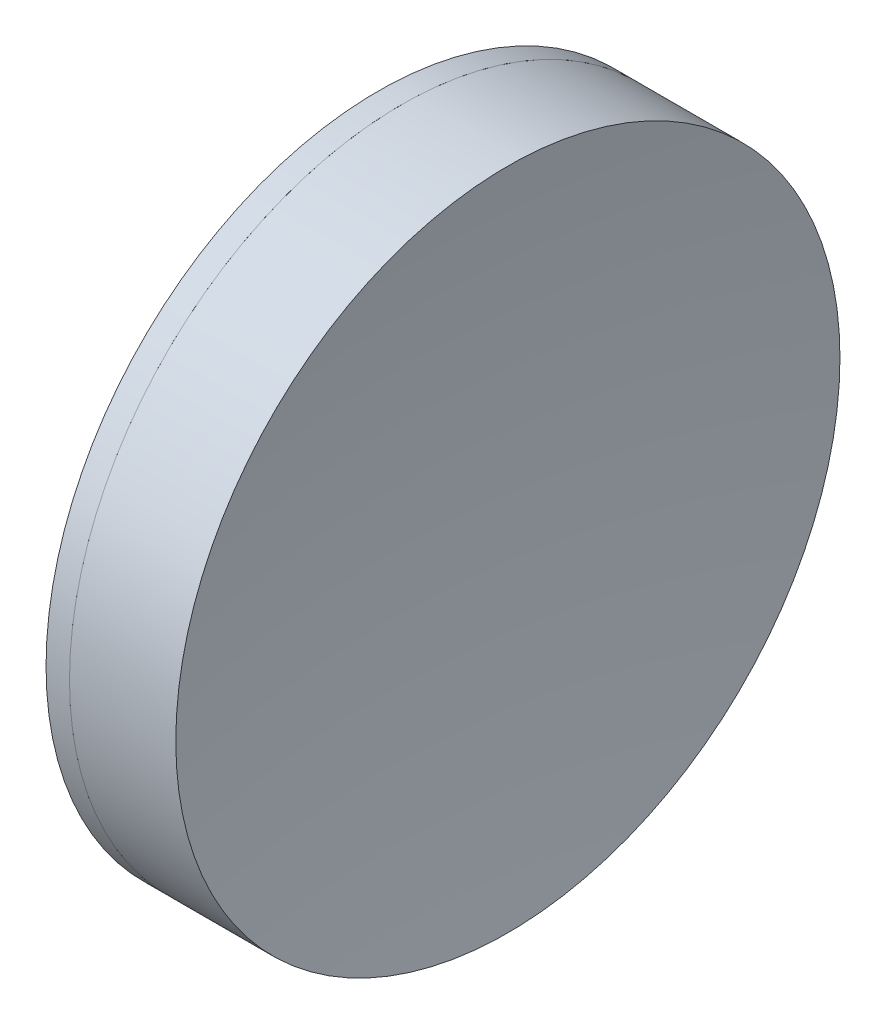
ISO-10303-21;
HEADER;
FILE_DESCRIPTION(('STEP AP214'),'2;1');
FILE_NAME('part.step','',(''),(''),'','','');
FILE_SCHEMA(('AUTOMOTIVE_DESIGN { 1 0 10303 214 1 1 1 1 }'));
ENDSEC;
DATA;
#1=APPLICATION_CONTEXT('core data for automotive mechanical design processes');
#2=APPLICATION_PROTOCOL_DEFINITION('international standard','automotive_design',2000,#1);
#3=PRODUCT_CONTEXT('',#1,'mechanical');
#4=PRODUCT('Part','Part','',(#3));
#5=PRODUCT_RELATED_PRODUCT_CATEGORY('part','',(#4));
#6=PRODUCT_DEFINITION_FORMATION('','',#4);
#7=PRODUCT_DEFINITION_CONTEXT('part definition',#1,'design');
#8=PRODUCT_DEFINITION('design','',#6,#7);
#9=PRODUCT_DEFINITION_SHAPE('','',#8);
#10=(LENGTH_UNIT() NAMED_UNIT(*) SI_UNIT(.MILLI.,.METRE.));
#11=(NAMED_UNIT(*) PLANE_ANGLE_UNIT() SI_UNIT($,.RADIAN.));
#12=(NAMED_UNIT(*) SI_UNIT($,.STERADIAN.) SOLID_ANGLE_UNIT());
#13=UNCERTAINTY_MEASURE_WITH_UNIT(LENGTH_MEASURE(1.E-05),#10,'distance_accuracy_value','');
#14=(GEOMETRIC_REPRESENTATION_CONTEXT(3) GLOBAL_UNCERTAINTY_ASSIGNED_CONTEXT((#13)) GLOBAL_UNIT_ASSIGNED_CONTEXT((#10,
#11,#12)) REPRESENTATION_CONTEXT('',''));
#15=CARTESIAN_POINT('',(0.,0.,0.));
#16=DIRECTION('',(0.,0.,1.));
#17=DIRECTION('',(1.,0.,0.));
#18=AXIS2_PLACEMENT_3D('',#15,#16,#17);
#19=CARTESIAN_POINT('',(86.3079002687381,0.,0.));
#20=DIRECTION('',(-1.,0.,0.));
#21=DIRECTION('',(0.,0.,-1.));
#22=AXIS2_PLACEMENT_3D('',#19,#20,#21);
#23=SPHERICAL_SURFACE('',#22,103.2);
#24=CARTESIAN_POINT('',(186.333297043757,0.,0.));
#25=DIRECTION('',(-1.,0.,0.));
#26=DIRECTION('',(0.,0.,1.));
#27=AXIS2_PLACEMENT_3D('',#24,#25,#26);
#28=CIRCLE('',#27,25.4);
#29=CARTESIAN_POINT('',(186.333297043757,0.,25.4));
#30=VERTEX_POINT('',#29);
#31=EDGE_CURVE('E51',#30,#30,#28,.T.);
#32=ORIENTED_EDGE('',*,*,#31,.T.);
#33=EDGE_LOOP('',(#32));
#34=FACE_BOUND('',#33,.T.);
#35=ADVANCED_FACE('F45',(#34),#23,.F.);
#36=CARTESIAN_POINT('',(358.467900268738,0.,0.));
#37=DIRECTION('',(-1.,0.,0.));
#38=DIRECTION('',(0.,0.,-1.));
#39=AXIS2_PLACEMENT_3D('',#36,#37,#38);
#40=SPHERICAL_SURFACE('',#39,165.96);
#41=CARTESIAN_POINT('',(194.463139362233,0.,0.));
#42=DIRECTION('',(-1.,0.,0.));
#43=DIRECTION('',(0.,0.,1.));
#44=AXIS2_PLACEMENT_3D('',#41,#42,#43);
#45=CIRCLE('',#44,25.4);
#46=CARTESIAN_POINT('',(194.463139362233,0.,25.4));
#47=VERTEX_POINT('',#46);
#48=EDGE_CURVE('E11',#47,#47,#45,.T.);
#49=ORIENTED_EDGE('',*,*,#48,.F.);
#50=EDGE_LOOP('',(#49));
#51=FACE_BOUND('',#50,.T.);
#52=ADVANCED_FACE('F60',(#51),#40,.F.);
#53=CARTESIAN_POINT('',(-0.551919992657797,0.,0.));
#54=DIRECTION('',(-1.,0.,0.));
#55=DIRECTION('',(0.,0.,1.));
#56=AXIS2_PLACEMENT_3D('',#53,#54,#55);
#57=CYLINDRICAL_SURFACE('',#56,25.4);
#58=ORIENTED_EDGE('',*,*,#48,.T.);
#59=EDGE_LOOP('',(#58));
#60=FACE_BOUND('',#59,.T.);
#61=ORIENTED_EDGE('',*,*,#31,.F.);
#62=EDGE_LOOP('',(#61));
#63=FACE_BOUND('',#62,.T.);
#64=ADVANCED_FACE('F58',(#60,#63),#57,.T.);
#65=CLOSED_SHELL('',(#35,#52,#64));
#66=MANIFOLD_SOLID_BREP('B2',#65);
#67=CARTESIAN_POINT('',(266.807900268738,0.,0.));
#68=DIRECTION('',(-1.,0.,0.));
#69=DIRECTION('',(0.,0.,-1.));
#70=AXIS2_PLACEMENT_3D('',#67,#68,#69);
#71=SPHERICAL_SURFACE('',#70,86.1);
#72=CARTESIAN_POINT('',(184.539741179088,0.,0.));
#73=DIRECTION('',(-1.,0.,0.));
#74=DIRECTION('',(0.,0.,1.));
#75=AXIS2_PLACEMENT_3D('',#72,#73,#74);
#76=CIRCLE('',#75,25.4);
#77=CARTESIAN_POINT('',(184.539741179088,0.,25.4));
#78=VERTEX_POINT('',#77);
#79=EDGE_CURVE('E44',#78,#78,#76,.T.);
#80=ORIENTED_EDGE('',*,*,#79,.T.);
#81=EDGE_LOOP('',(#80));
#82=FACE_BOUND('',#81,.T.);
#83=ADVANCED_FACE('F86',(#82),#71,.T.);
#84=CARTESIAN_POINT('',(-0.816062176165804,0.,0.));
#85=DIRECTION('',(-1.,0.,0.));
#86=DIRECTION('',(0.,0.,1.));
#87=AXIS2_PLACEMENT_3D('',#84,#85,#86);
#88=CYLINDRICAL_SURFACE('',#87,25.4);
#89=CARTESIAN_POINT('',(186.333297043757,0.,0.));
#90=DIRECTION('',(-1.,0.,0.));
#91=DIRECTION('',(0.,0.,1.));
#92=AXIS2_PLACEMENT_3D('',#89,#90,#91);
#93=CIRCLE('',#92,25.4);
#94=CARTESIAN_POINT('',(186.333297043757,0.,25.4));
#95=VERTEX_POINT('',#94);
#96=EDGE_CURVE('E92',#95,#95,#93,.T.);
#97=ORIENTED_EDGE('',*,*,#96,.T.);
#98=EDGE_LOOP('',(#97));
#99=FACE_BOUND('',#98,.T.);
#100=ORIENTED_EDGE('',*,*,#79,.F.);
#101=EDGE_LOOP('',(#100));
#102=FACE_BOUND('',#101,.T.);
#103=ADVANCED_FACE('F98',(#99,#102),#88,.T.);
#104=CARTESIAN_POINT('',(86.3079002687381,0.,0.));
#105=DIRECTION('',(-1.,0.,0.));
#106=DIRECTION('',(0.,0.,1.));
#107=AXIS2_PLACEMENT_3D('',#104,#105,#106);
#108=SPHERICAL_SURFACE('',#107,103.2);
#109=ORIENTED_EDGE('',*,*,#96,.F.);
#110=EDGE_LOOP('',(#109));
#111=FACE_BOUND('',#110,.T.);
#112=ADVANCED_FACE('F101',(#111),#108,.T.);
#113=CLOSED_SHELL('',(#83,#103,#112));
#114=MANIFOLD_SOLID_BREP('B6',#113);
#115=ADVANCED_BREP_SHAPE_REPRESENTATION('',(#18,#66,#114),#14);
#116=SHAPE_DEFINITION_REPRESENTATION(#9,#115);
ENDSEC;
END-ISO-10303-21;
